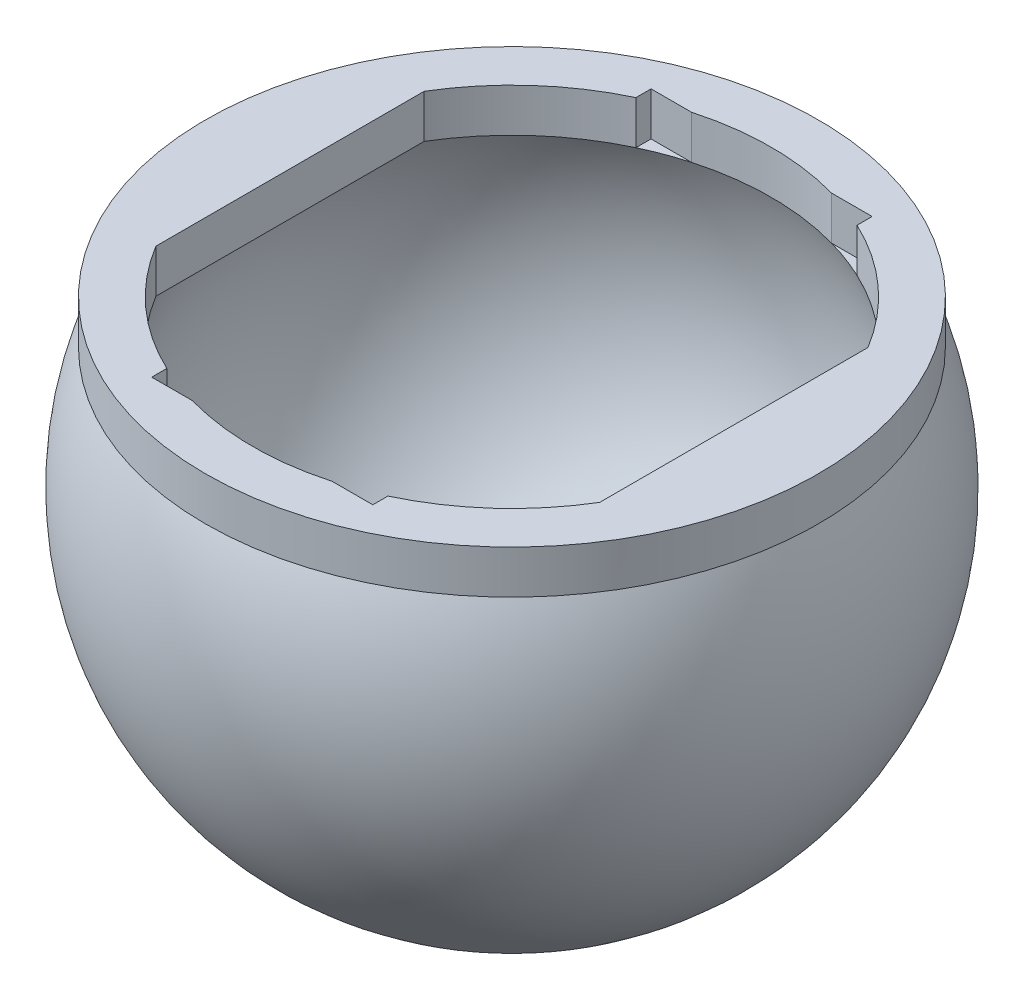
ISO-10303-21;
HEADER;
FILE_DESCRIPTION(('STEP AP214'),'2;1');
FILE_NAME('part.step','',(''),(''),'','','');
FILE_SCHEMA(('AUTOMOTIVE_DESIGN { 1 0 10303 214 1 1 1 1 }'));
ENDSEC;
DATA;
#1=APPLICATION_CONTEXT('core data for automotive mechanical design processes');
#2=APPLICATION_PROTOCOL_DEFINITION('international standard','automotive_design',2000,#1);
#3=PRODUCT_CONTEXT('',#1,'mechanical');
#4=PRODUCT('Part','Part','',(#3));
#5=PRODUCT_RELATED_PRODUCT_CATEGORY('part','',(#4));
#6=PRODUCT_DEFINITION_FORMATION('','',#4);
#7=PRODUCT_DEFINITION_CONTEXT('part definition',#1,'design');
#8=PRODUCT_DEFINITION('design','',#6,#7);
#9=PRODUCT_DEFINITION_SHAPE('','',#8);
#10=(LENGTH_UNIT() NAMED_UNIT(*) SI_UNIT(.MILLI.,.METRE.));
#11=(NAMED_UNIT(*) PLANE_ANGLE_UNIT() SI_UNIT($,.RADIAN.));
#12=(NAMED_UNIT(*) SI_UNIT($,.STERADIAN.) SOLID_ANGLE_UNIT());
#13=UNCERTAINTY_MEASURE_WITH_UNIT(LENGTH_MEASURE(1.E-05),#10,'distance_accuracy_value','');
#14=(GEOMETRIC_REPRESENTATION_CONTEXT(3) GLOBAL_UNCERTAINTY_ASSIGNED_CONTEXT((#13)) GLOBAL_UNIT_ASSIGNED_CONTEXT((#10,
#11,#12)) REPRESENTATION_CONTEXT('',''));
#15=CARTESIAN_POINT('',(0.,0.,0.));
#16=DIRECTION('',(0.,0.,1.));
#17=DIRECTION('',(1.,0.,0.));
#18=AXIS2_PLACEMENT_3D('',#15,#16,#17);
#19=CARTESIAN_POINT('',(0.,9.5,0.));
#20=DIRECTION('',(0.,-1.,0.));
#21=DIRECTION('',(0.,0.,-1.));
#22=AXIS2_PLACEMENT_3D('',#19,#20,#21);
#23=CYLINDRICAL_SURFACE('',#22,14.9415527974839);
#24=DIRECTION('',(0.,1.,0.));
#25=VECTOR('',#24,1.);
#26=CARTESIAN_POINT('',(6.37,7.,-13.5156612860785));
#27=LINE('',#26,#25);
#28=CARTESIAN_POINT('',(6.37,7.,-13.5156612860785));
#29=VERTEX_POINT('',#28);
#30=CARTESIAN_POINT('',(6.37,9.5,-13.5156612860785));
#31=VERTEX_POINT('',#30);
#32=EDGE_CURVE('E192',#29,#31,#27,.T.);
#33=ORIENTED_EDGE('',*,*,#32,.F.);
#34=CARTESIAN_POINT('',(0.,7.,0.));
#35=DIRECTION('',(0.,1.,0.));
#36=DIRECTION('',(0.,0.,1.));
#37=AXIS2_PLACEMENT_3D('',#34,#35,#36);
#38=CIRCLE('',#37,14.9415527974839);
#39=CARTESIAN_POINT('',(12.7867436961671,7.,-7.72975974067315));
#40=VERTEX_POINT('',#39);
#41=EDGE_CURVE('E267',#29,#40,#38,.F.);
#42=ORIENTED_EDGE('',*,*,#41,.T.);
#43=DIRECTION('',(0.,-1.,0.));
#44=VECTOR('',#43,1.);
#45=CARTESIAN_POINT('',(12.7867436961671,9.5,-7.72975974067315));
#46=LINE('',#45,#44);
#47=CARTESIAN_POINT('',(12.7867436961671,9.5,-7.72975974067315));
#48=VERTEX_POINT('',#47);
#49=EDGE_CURVE('E331',#48,#40,#46,.T.);
#50=ORIENTED_EDGE('',*,*,#49,.F.);
#51=CARTESIAN_POINT('',(0.,9.5,0.));
#52=DIRECTION('',(0.,1.,0.));
#53=DIRECTION('',(0.,0.,1.));
#54=AXIS2_PLACEMENT_3D('',#51,#52,#53);
#55=CIRCLE('',#54,14.9415527974839);
#56=EDGE_CURVE('E280',#31,#48,#55,.F.);
#57=ORIENTED_EDGE('',*,*,#56,.F.);
#58=EDGE_LOOP('',(#33,#42,#50,#57));
#59=FACE_BOUND('',#58,.T.);
#60=ADVANCED_FACE('F40',(#59),#23,.F.);
#61=CARTESIAN_POINT('',(-4.03112887414927,7.,-14.3874945699382));
#62=VERTEX_POINT('',#61);
#63=CARTESIAN_POINT('',(4.03112887414927,7.,-14.3874945699382));
#64=VERTEX_POINT('',#63);
#65=EDGE_CURVE('E303',#62,#64,#38,.F.);
#66=ORIENTED_EDGE('',*,*,#65,.T.);
#67=DIRECTION('',(0.,1.,0.));
#68=VECTOR('',#67,1.);
#69=CARTESIAN_POINT('',(4.03112887414927,7.,-14.3874945699382));
#70=LINE('',#69,#68);
#71=CARTESIAN_POINT('',(4.03112887414927,9.5,-14.3874945699382));
#72=VERTEX_POINT('',#71);
#73=EDGE_CURVE('E168',#64,#72,#70,.T.);
#74=ORIENTED_EDGE('',*,*,#73,.T.);
#75=CARTESIAN_POINT('',(-4.03112887414927,9.5,-14.3874945699382));
#76=VERTEX_POINT('',#75);
#77=EDGE_CURVE('E279',#76,#72,#55,.F.);
#78=ORIENTED_EDGE('',*,*,#77,.F.);
#79=DIRECTION('',(0.,1.,0.));
#80=VECTOR('',#79,1.);
#81=CARTESIAN_POINT('',(-4.03112887414927,7.,-14.3874945699382));
#82=LINE('',#81,#80);
#83=EDGE_CURVE('E264',#62,#76,#82,.T.);
#84=ORIENTED_EDGE('',*,*,#83,.F.);
#85=EDGE_LOOP('',(#66,#74,#78,#84));
#86=FACE_BOUND('',#85,.T.);
#87=ADVANCED_FACE('F397',(#86),#23,.F.);
#88=CARTESIAN_POINT('',(0.,9.5,0.));
#89=DIRECTION('',(0.,-1.,0.));
#90=DIRECTION('',(0.,0.,-1.));
#91=AXIS2_PLACEMENT_3D('',#88,#89,#90);
#92=CYLINDRICAL_SURFACE('',#91,14.9415527974839);
#93=DIRECTION('',(0.,1.,0.));
#94=VECTOR('',#93,1.);
#95=CARTESIAN_POINT('',(-6.37,7.,13.5156612860785));
#96=LINE('',#95,#94);
#97=CARTESIAN_POINT('',(-6.37,7.,13.5156612860785));
#98=VERTEX_POINT('',#97);
#99=CARTESIAN_POINT('',(-6.37,9.5,13.5156612860785));
#100=VERTEX_POINT('',#99);
#101=EDGE_CURVE('E212',#98,#100,#96,.T.);
#102=ORIENTED_EDGE('',*,*,#101,.F.);
#103=CARTESIAN_POINT('',(0.,7.,0.));
#104=DIRECTION('',(0.,1.,0.));
#105=DIRECTION('',(0.,0.,1.));
#106=AXIS2_PLACEMENT_3D('',#103,#104,#105);
#107=CIRCLE('',#106,14.9415527974839);
#108=CARTESIAN_POINT('',(-12.7867436961671,7.,7.72975974067315));
#109=VERTEX_POINT('',#108);
#110=EDGE_CURVE('E307',#98,#109,#107,.F.);
#111=ORIENTED_EDGE('',*,*,#110,.T.);
#112=DIRECTION('',(0.,-1.,0.));
#113=VECTOR('',#112,1.);
#114=CARTESIAN_POINT('',(-12.7867436961671,9.5,7.72975974067315));
#115=LINE('',#114,#113);
#116=CARTESIAN_POINT('',(-12.7867436961671,9.5,7.72975974067315));
#117=VERTEX_POINT('',#116);
#118=EDGE_CURVE('E324',#117,#109,#115,.T.);
#119=ORIENTED_EDGE('',*,*,#118,.F.);
#120=CARTESIAN_POINT('',(0.,9.5,0.));
#121=DIRECTION('',(0.,1.,0.));
#122=DIRECTION('',(0.,0.,1.));
#123=AXIS2_PLACEMENT_3D('',#120,#121,#122);
#124=CIRCLE('',#123,14.9415527974839);
#125=EDGE_CURVE('E283',#100,#117,#124,.F.);
#126=ORIENTED_EDGE('',*,*,#125,.F.);
#127=EDGE_LOOP('',(#102,#111,#119,#126));
#128=FACE_BOUND('',#127,.T.);
#129=ADVANCED_FACE('F355',(#128),#92,.F.);
#130=CARTESIAN_POINT('',(4.03112887414927,7.,14.3874945699382));
#131=VERTEX_POINT('',#130);
#132=CARTESIAN_POINT('',(-4.03112887414927,7.,14.3874945699382));
#133=VERTEX_POINT('',#132);
#134=EDGE_CURVE('E313',#131,#133,#107,.F.);
#135=ORIENTED_EDGE('',*,*,#134,.T.);
#136=DIRECTION('',(0.,1.,0.));
#137=VECTOR('',#136,1.);
#138=CARTESIAN_POINT('',(-4.03112887414927,7.,14.3874945699382));
#139=LINE('',#138,#137);
#140=CARTESIAN_POINT('',(-4.03112887414927,9.5,14.3874945699382));
#141=VERTEX_POINT('',#140);
#142=EDGE_CURVE('E241',#133,#141,#139,.T.);
#143=ORIENTED_EDGE('',*,*,#142,.T.);
#144=CARTESIAN_POINT('',(4.03112887414927,9.5,14.3874945699382));
#145=VERTEX_POINT('',#144);
#146=EDGE_CURVE('E289',#145,#141,#124,.F.);
#147=ORIENTED_EDGE('',*,*,#146,.F.);
#148=DIRECTION('',(0.,1.,0.));
#149=VECTOR('',#148,1.);
#150=CARTESIAN_POINT('',(4.03112887414927,7.,14.3874945699382));
#151=LINE('',#150,#149);
#152=EDGE_CURVE('E189',#131,#145,#151,.T.);
#153=ORIENTED_EDGE('',*,*,#152,.F.);
#154=EDGE_LOOP('',(#135,#143,#147,#153));
#155=FACE_BOUND('',#154,.T.);
#156=ADVANCED_FACE('F363',(#155),#92,.F.);
#157=CARTESIAN_POINT('',(0.,9.5,0.));
#158=DIRECTION('',(0.,1.,0.));
#159=DIRECTION('',(0.,0.,1.));
#160=AXIS2_PLACEMENT_3D('',#157,#158,#159);
#161=PLANE('',#160);
#162=CARTESIAN_POINT('',(0.,9.5,0.));
#163=DIRECTION('',(0.,1.,0.));
#164=DIRECTION('',(0.,0.,1.));
#165=AXIS2_PLACEMENT_3D('',#162,#163,#164);
#166=CIRCLE('',#165,17.6635217326557);
#167=CARTESIAN_POINT('',(0.,9.5,17.6635217326557));
#168=VERTEX_POINT('',#167);
#169=EDGE_CURVE('E293',#168,#168,#166,.T.);
#170=ORIENTED_EDGE('',*,*,#169,.T.);
#171=EDGE_LOOP('',(#170));
#172=FACE_BOUND('',#171,.T.);
#173=DIRECTION('',(1.,0.,0.));
#174=VECTOR('',#173,1.);
#175=CARTESIAN_POINT('',(0.,9.5,14.3874945699382));
#176=LINE('',#175,#174);
#177=CARTESIAN_POINT('',(-6.36999999999999,9.5,14.3874945699382));
#178=VERTEX_POINT('',#177);
#179=EDGE_CURVE('E226',#178,#141,#176,.T.);
#180=ORIENTED_EDGE('',*,*,#179,.F.);
#181=DIRECTION('',(0.,0.,-1.));
#182=VECTOR('',#181,1.);
#183=CARTESIAN_POINT('',(-6.37000000000004,9.5,0.));
#184=LINE('',#183,#182);
#185=EDGE_CURVE('E233',#178,#100,#184,.T.);
#186=ORIENTED_EDGE('',*,*,#185,.T.);
#187=ORIENTED_EDGE('',*,*,#125,.T.);
#188=DIRECTION('',(0.,0.,1.));
#189=VECTOR('',#188,1.);
#190=CARTESIAN_POINT('',(-12.7867436961671,9.5,0.));
#191=LINE('',#190,#189);
#192=CARTESIAN_POINT('',(-12.7867436961671,9.5,-7.72975974067315));
#193=VERTEX_POINT('',#192);
#194=EDGE_CURVE('E288',#193,#117,#191,.T.);
#195=ORIENTED_EDGE('',*,*,#194,.F.);
#196=CARTESIAN_POINT('',(-6.37,9.5,-13.5156612860785));
#197=VERTEX_POINT('',#196);
#198=EDGE_CURVE('E274',#193,#197,#55,.F.);
#199=ORIENTED_EDGE('',*,*,#198,.T.);
#200=DIRECTION('',(0.,0.,1.));
#201=VECTOR('',#200,1.);
#202=CARTESIAN_POINT('',(-6.37000000000004,9.5,0.));
#203=LINE('',#202,#201);
#204=CARTESIAN_POINT('',(-6.36999999999999,9.5,-14.3874945699382));
#205=VERTEX_POINT('',#204);
#206=EDGE_CURVE('E251',#205,#197,#203,.T.);
#207=ORIENTED_EDGE('',*,*,#206,.F.);
#208=DIRECTION('',(1.,0.,0.));
#209=VECTOR('',#208,1.);
#210=CARTESIAN_POINT('',(0.,9.5,-14.3874945699382));
#211=LINE('',#210,#209);
#212=EDGE_CURVE('E195',#205,#76,#211,.T.);
#213=ORIENTED_EDGE('',*,*,#212,.T.);
#214=ORIENTED_EDGE('',*,*,#77,.T.);
#215=DIRECTION('',(-1.,0.,0.));
#216=VECTOR('',#215,1.);
#217=CARTESIAN_POINT('',(0.,9.5,-14.3874945699382));
#218=LINE('',#217,#216);
#219=CARTESIAN_POINT('',(6.36999999999999,9.5,-14.3874945699382));
#220=VERTEX_POINT('',#219);
#221=EDGE_CURVE('E178',#220,#72,#218,.T.);
#222=ORIENTED_EDGE('',*,*,#221,.F.);
#223=DIRECTION('',(0.,0.,1.));
#224=VECTOR('',#223,1.);
#225=CARTESIAN_POINT('',(6.37000000000004,9.5,0.));
#226=LINE('',#225,#224);
#227=EDGE_CURVE('E163',#220,#31,#226,.T.);
#228=ORIENTED_EDGE('',*,*,#227,.T.);
#229=ORIENTED_EDGE('',*,*,#56,.T.);
#230=DIRECTION('',(0.,0.,1.));
#231=VECTOR('',#230,1.);
#232=CARTESIAN_POINT('',(12.7867436961671,9.5,0.));
#233=LINE('',#232,#231);
#234=CARTESIAN_POINT('',(12.7867436961671,9.5,7.72975974067315));
#235=VERTEX_POINT('',#234);
#236=EDGE_CURVE('E278',#48,#235,#233,.T.);
#237=ORIENTED_EDGE('',*,*,#236,.T.);
#238=CARTESIAN_POINT('',(6.37,9.5,13.5156612860785));
#239=VERTEX_POINT('',#238);
#240=EDGE_CURVE('E284',#235,#239,#124,.F.);
#241=ORIENTED_EDGE('',*,*,#240,.T.);
#242=DIRECTION('',(0.,0.,-1.));
#243=VECTOR('',#242,1.);
#244=CARTESIAN_POINT('',(6.37000000000004,9.5,0.));
#245=LINE('',#244,#243);
#246=CARTESIAN_POINT('',(6.36999999999999,9.5,14.3874945699382));
#247=VERTEX_POINT('',#246);
#248=EDGE_CURVE('E201',#247,#239,#245,.T.);
#249=ORIENTED_EDGE('',*,*,#248,.F.);
#250=DIRECTION('',(-1.,0.,0.));
#251=VECTOR('',#250,1.);
#252=CARTESIAN_POINT('',(0.,9.5,14.3874945699382));
#253=LINE('',#252,#251);
#254=EDGE_CURVE('E208',#247,#145,#253,.T.);
#255=ORIENTED_EDGE('',*,*,#254,.T.);
#256=ORIENTED_EDGE('',*,*,#146,.T.);
#257=EDGE_LOOP('',(#180,#186,#187,#195,#199,#207,#213,#214,#222,#228,#229,#237,#241,#249,#255,#256));
#258=FACE_BOUND('',#257,.T.);
#259=ADVANCED_FACE('F376',(#172,#258),#161,.T.);
#260=CARTESIAN_POINT('',(0.,0.,0.));
#261=DIRECTION('',(0.,-1.,0.));
#262=DIRECTION('',(-1.,0.,0.));
#263=AXIS2_PLACEMENT_3D('',#260,#261,#262);
#264=SPHERICAL_SURFACE('',#263,19.);
#265=CARTESIAN_POINT('',(0.,7.,0.));
#266=DIRECTION('',(0.,1.,0.));
#267=DIRECTION('',(0.,0.,1.));
#268=AXIS2_PLACEMENT_3D('',#265,#266,#267);
#269=CIRCLE('',#268,17.6635217326557);
#270=CARTESIAN_POINT('',(0.,7.,17.6635217326557));
#271=VERTEX_POINT('',#270);
#272=EDGE_CURVE('E317',#271,#271,#269,.T.);
#273=ORIENTED_EDGE('',*,*,#272,.F.);
#274=EDGE_LOOP('',(#273));
#275=FACE_BOUND('',#274,.T.);
#276=ADVANCED_FACE('F42',(#275),#264,.T.);
#277=CARTESIAN_POINT('',(0.,7.,0.));
#278=DIRECTION('',(0.,1.,0.));
#279=DIRECTION('',(0.,0.,1.));
#280=AXIS2_PLACEMENT_3D('',#277,#278,#279);
#281=PLANE('',#280);
#282=DIRECTION('',(0.,0.,1.));
#283=VECTOR('',#282,1.);
#284=CARTESIAN_POINT('',(-12.7867436961671,7.,0.));
#285=LINE('',#284,#283);
#286=CARTESIAN_POINT('',(-12.7867436961671,7.,-7.72975974067315));
#287=VERTEX_POINT('',#286);
#288=EDGE_CURVE('E312',#287,#109,#285,.T.);
#289=ORIENTED_EDGE('',*,*,#288,.T.);
#290=CARTESIAN_POINT('',(0.,7.,0.));
#291=DIRECTION('',(0.,-1.,0.));
#292=DIRECTION('',(0.,0.,-1.));
#293=AXIS2_PLACEMENT_3D('',#290,#291,#292);
#294=CIRCLE('',#293,14.9415527974839);
#295=EDGE_CURVE('E49',#109,#287,#294,.T.);
#296=ORIENTED_EDGE('',*,*,#295,.T.);
#297=EDGE_LOOP('',(#289,#296));
#298=FACE_BOUND('',#297,.T.);
#299=ADVANCED_FACE('F341',(#298),#281,.F.);
#300=DIRECTION('',(0.,0.,1.));
#301=VECTOR('',#300,1.);
#302=CARTESIAN_POINT('',(12.7867436961671,7.,0.));
#303=LINE('',#302,#301);
#304=CARTESIAN_POINT('',(12.7867436961671,7.,7.72975974067315));
#305=VERTEX_POINT('',#304);
#306=EDGE_CURVE('E302',#40,#305,#303,.T.);
#307=ORIENTED_EDGE('',*,*,#306,.F.);
#308=EDGE_CURVE('E11',#40,#305,#294,.T.);
#309=ORIENTED_EDGE('',*,*,#308,.T.);
#310=EDGE_LOOP('',(#307,#309));
#311=FACE_BOUND('',#310,.T.);
#312=ADVANCED_FACE('F405',(#311),#281,.F.);
#313=CARTESIAN_POINT('',(-6.37,7.,-13.5156612860785));
#314=VERTEX_POINT('',#313);
#315=EDGE_CURVE('E298',#287,#314,#38,.F.);
#316=ORIENTED_EDGE('',*,*,#315,.T.);
#317=DIRECTION('',(0.,1.,0.));
#318=VECTOR('',#317,1.);
#319=CARTESIAN_POINT('',(-6.37,7.,-13.5156612860785));
#320=LINE('',#319,#318);
#321=EDGE_CURVE('E268',#314,#197,#320,.T.);
#322=ORIENTED_EDGE('',*,*,#321,.T.);
#323=ORIENTED_EDGE('',*,*,#198,.F.);
#324=DIRECTION('',(0.,-1.,0.));
#325=VECTOR('',#324,1.);
#326=CARTESIAN_POINT('',(-12.7867436961671,9.5,-7.72975974067315));
#327=LINE('',#326,#325);
#328=EDGE_CURVE('E297',#193,#287,#327,.T.);
#329=ORIENTED_EDGE('',*,*,#328,.T.);
#330=EDGE_LOOP('',(#316,#322,#323,#329));
#331=FACE_BOUND('',#330,.T.);
#332=ADVANCED_FACE('F347',(#331),#23,.F.);
#333=CARTESIAN_POINT('',(12.7867436961671,9.5,0.));
#334=DIRECTION('',(1.,0.,0.));
#335=DIRECTION('',(0.,0.,-1.));
#336=AXIS2_PLACEMENT_3D('',#333,#334,#335);
#337=PLANE('',#336);
#338=ORIENTED_EDGE('',*,*,#306,.T.);
#339=DIRECTION('',(0.,-1.,0.));
#340=VECTOR('',#339,1.);
#341=CARTESIAN_POINT('',(12.7867436961671,9.5,7.72975974067315));
#342=LINE('',#341,#340);
#343=EDGE_CURVE('E328',#235,#305,#342,.T.);
#344=ORIENTED_EDGE('',*,*,#343,.F.);
#345=ORIENTED_EDGE('',*,*,#236,.F.);
#346=ORIENTED_EDGE('',*,*,#49,.T.);
#347=EDGE_LOOP('',(#338,#344,#345,#346));
#348=FACE_BOUND('',#347,.T.);
#349=ADVANCED_FACE('F407',(#348),#337,.F.);
#350=CARTESIAN_POINT('',(6.37,7.,13.5156612860785));
#351=VERTEX_POINT('',#350);
#352=EDGE_CURVE('E308',#305,#351,#107,.F.);
#353=ORIENTED_EDGE('',*,*,#352,.T.);
#354=DIRECTION('',(0.,1.,0.));
#355=VECTOR('',#354,1.);
#356=CARTESIAN_POINT('',(6.37,7.,13.5156612860785));
#357=LINE('',#356,#355);
#358=EDGE_CURVE('E217',#351,#239,#357,.T.);
#359=ORIENTED_EDGE('',*,*,#358,.T.);
#360=ORIENTED_EDGE('',*,*,#240,.F.);
#361=ORIENTED_EDGE('',*,*,#343,.T.);
#362=EDGE_LOOP('',(#353,#359,#360,#361));
#363=FACE_BOUND('',#362,.T.);
#364=ADVANCED_FACE('F410',(#363),#92,.F.);
#365=CARTESIAN_POINT('',(-12.7867436961671,9.5,0.));
#366=DIRECTION('',(1.,0.,0.));
#367=DIRECTION('',(0.,0.,-1.));
#368=AXIS2_PLACEMENT_3D('',#365,#366,#367);
#369=PLANE('',#368);
#370=ORIENTED_EDGE('',*,*,#288,.F.);
#371=ORIENTED_EDGE('',*,*,#328,.F.);
#372=ORIENTED_EDGE('',*,*,#194,.T.);
#373=ORIENTED_EDGE('',*,*,#118,.T.);
#374=EDGE_LOOP('',(#370,#371,#372,#373));
#375=FACE_BOUND('',#374,.T.);
#376=ADVANCED_FACE('F350',(#375),#369,.T.);
#377=CARTESIAN_POINT('',(0.,9.5,0.));
#378=DIRECTION('',(0.,-1.,0.));
#379=DIRECTION('',(0.,0.,-1.));
#380=AXIS2_PLACEMENT_3D('',#377,#378,#379);
#381=CYLINDRICAL_SURFACE('',#380,17.6635217326557);
#382=ORIENTED_EDGE('',*,*,#169,.F.);
#383=EDGE_LOOP('',(#382));
#384=FACE_BOUND('',#383,.T.);
#385=ORIENTED_EDGE('',*,*,#272,.T.);
#386=EDGE_LOOP('',(#385));
#387=FACE_BOUND('',#386,.T.);
#388=ADVANCED_FACE('F449',(#384,#387),#381,.T.);
#389=CARTESIAN_POINT('',(0.,0.,0.));
#390=DIRECTION('',(0.,-1.,0.));
#391=DIRECTION('',(-1.,0.,0.));
#392=AXIS2_PLACEMENT_3D('',#389,#390,#391);
#393=SPHERICAL_SURFACE('',#392,16.5);
#394=ORIENTED_EDGE('',*,*,#308,.F.);
#395=ORIENTED_EDGE('',*,*,#41,.F.);
#396=CARTESIAN_POINT('',(0.,7.,0.));
#397=DIRECTION('',(0.,1.,0.));
#398=DIRECTION('',(0.,0.,1.));
#399=AXIS2_PLACEMENT_3D('',#396,#397,#398);
#400=CIRCLE('',#399,14.9415527974839);
#401=EDGE_CURVE('E169',#64,#29,#400,.F.);
#402=ORIENTED_EDGE('',*,*,#401,.F.);
#403=ORIENTED_EDGE('',*,*,#65,.F.);
#404=CARTESIAN_POINT('',(0.,7.,0.));
#405=DIRECTION('',(0.,1.,0.));
#406=DIRECTION('',(0.,0.,1.));
#407=AXIS2_PLACEMENT_3D('',#404,#405,#406);
#408=CIRCLE('',#407,14.9415527974839);
#409=EDGE_CURVE('E254',#314,#62,#408,.F.);
#410=ORIENTED_EDGE('',*,*,#409,.F.);
#411=ORIENTED_EDGE('',*,*,#315,.F.);
#412=ORIENTED_EDGE('',*,*,#295,.F.);
#413=ORIENTED_EDGE('',*,*,#110,.F.);
#414=CARTESIAN_POINT('',(0.,7.,0.));
#415=DIRECTION('',(0.,1.,0.));
#416=DIRECTION('',(0.,0.,1.));
#417=AXIS2_PLACEMENT_3D('',#414,#415,#416);
#418=CIRCLE('',#417,14.9415527974839);
#419=EDGE_CURVE('E229',#133,#98,#418,.F.);
#420=ORIENTED_EDGE('',*,*,#419,.F.);
#421=ORIENTED_EDGE('',*,*,#134,.F.);
#422=CARTESIAN_POINT('',(0.,7.,0.));
#423=DIRECTION('',(0.,1.,0.));
#424=DIRECTION('',(0.,0.,1.));
#425=AXIS2_PLACEMENT_3D('',#422,#423,#424);
#426=CIRCLE('',#425,14.9415527974839);
#427=EDGE_CURVE('E204',#351,#131,#426,.F.);
#428=ORIENTED_EDGE('',*,*,#427,.F.);
#429=ORIENTED_EDGE('',*,*,#352,.F.);
#430=EDGE_LOOP('',(#394,#395,#402,#403,#410,#411,#412,#413,#420,#421,#428,#429));
#431=FACE_BOUND('',#430,.T.);
#432=ADVANCED_FACE('F368',(#431),#393,.F.);
#433=CARTESIAN_POINT('',(0.,7.,-14.3874945699382));
#434=DIRECTION('',(0.,0.,1.));
#435=DIRECTION('',(1.,0.,0.));
#436=AXIS2_PLACEMENT_3D('',#433,#434,#435);
#437=PLANE('',#436);
#438=ORIENTED_EDGE('',*,*,#212,.F.);
#439=DIRECTION('',(0.,1.,0.));
#440=VECTOR('',#439,1.);
#441=CARTESIAN_POINT('',(-6.36999999999999,7.,-14.3874945699382));
#442=LINE('',#441,#440);
#443=CARTESIAN_POINT('',(-6.36999999999999,7.,-14.3874945699382));
#444=VERTEX_POINT('',#443);
#445=EDGE_CURVE('E258',#444,#205,#442,.T.);
#446=ORIENTED_EDGE('',*,*,#445,.F.);
#447=DIRECTION('',(1.,0.,0.));
#448=VECTOR('',#447,1.);
#449=CARTESIAN_POINT('',(0.,7.,-14.3874945699382));
#450=LINE('',#449,#448);
#451=EDGE_CURVE('E247',#444,#62,#450,.T.);
#452=ORIENTED_EDGE('',*,*,#451,.T.);
#453=ORIENTED_EDGE('',*,*,#83,.T.);
#454=EDGE_LOOP('',(#438,#446,#452,#453));
#455=FACE_BOUND('',#454,.T.);
#456=ADVANCED_FACE('F392',(#455),#437,.T.);
#457=CARTESIAN_POINT('',(-6.37000000000004,7.,0.));
#458=DIRECTION('',(-1.,0.,0.));
#459=DIRECTION('',(0.,0.,1.));
#460=AXIS2_PLACEMENT_3D('',#457,#458,#459);
#461=PLANE('',#460);
#462=ORIENTED_EDGE('',*,*,#206,.T.);
#463=ORIENTED_EDGE('',*,*,#321,.F.);
#464=DIRECTION('',(0.,0.,1.));
#465=VECTOR('',#464,1.);
#466=CARTESIAN_POINT('',(-6.37000000000004,7.,0.));
#467=LINE('',#466,#465);
#468=EDGE_CURVE('E250',#444,#314,#467,.T.);
#469=ORIENTED_EDGE('',*,*,#468,.F.);
#470=ORIENTED_EDGE('',*,*,#445,.T.);
#471=EDGE_LOOP('',(#462,#463,#469,#470));
#472=FACE_BOUND('',#471,.T.);
#473=ADVANCED_FACE('F387',(#472),#461,.F.);
#474=CARTESIAN_POINT('',(0.,7.,0.));
#475=DIRECTION('',(0.,1.,0.));
#476=DIRECTION('',(0.,0.,1.));
#477=AXIS2_PLACEMENT_3D('',#474,#475,#476);
#478=PLANE('',#477);
#479=ORIENTED_EDGE('',*,*,#451,.F.);
#480=ORIENTED_EDGE('',*,*,#468,.T.);
#481=ORIENTED_EDGE('',*,*,#409,.T.);
#482=EDGE_LOOP('',(#479,#480,#481));
#483=FACE_BOUND('',#482,.T.);
#484=ADVANCED_FACE('F549',(#483),#478,.T.);
#485=CARTESIAN_POINT('',(6.37000000000004,7.,0.));
#486=DIRECTION('',(-1.,0.,0.));
#487=DIRECTION('',(0.,0.,1.));
#488=AXIS2_PLACEMENT_3D('',#485,#486,#487);
#489=PLANE('',#488);
#490=ORIENTED_EDGE('',*,*,#227,.F.);
#491=DIRECTION('',(0.,1.,0.));
#492=VECTOR('',#491,1.);
#493=CARTESIAN_POINT('',(6.36999999999999,7.,-14.3874945699382));
#494=LINE('',#493,#492);
#495=CARTESIAN_POINT('',(6.36999999999999,7.,-14.3874945699382));
#496=VERTEX_POINT('',#495);
#497=EDGE_CURVE('E157',#496,#220,#494,.T.);
#498=ORIENTED_EDGE('',*,*,#497,.F.);
#499=DIRECTION('',(0.,0.,1.));
#500=VECTOR('',#499,1.);
#501=CARTESIAN_POINT('',(6.37000000000004,7.,0.));
#502=LINE('',#501,#500);
#503=EDGE_CURVE('E160',#496,#29,#502,.T.);
#504=ORIENTED_EDGE('',*,*,#503,.T.);
#505=ORIENTED_EDGE('',*,*,#32,.T.);
#506=EDGE_LOOP('',(#490,#498,#504,#505));
#507=FACE_BOUND('',#506,.T.);
#508=ADVANCED_FACE('F159',(#507),#489,.T.);
#509=CARTESIAN_POINT('',(0.,7.,-14.3874945699382));
#510=DIRECTION('',(0.,0.,-1.));
#511=DIRECTION('',(-1.,0.,0.));
#512=AXIS2_PLACEMENT_3D('',#509,#510,#511);
#513=PLANE('',#512);
#514=ORIENTED_EDGE('',*,*,#221,.T.);
#515=ORIENTED_EDGE('',*,*,#73,.F.);
#516=DIRECTION('',(-1.,0.,0.));
#517=VECTOR('',#516,1.);
#518=CARTESIAN_POINT('',(0.,7.,-14.3874945699382));
#519=LINE('',#518,#517);
#520=EDGE_CURVE('E173',#496,#64,#519,.T.);
#521=ORIENTED_EDGE('',*,*,#520,.F.);
#522=ORIENTED_EDGE('',*,*,#497,.T.);
#523=EDGE_LOOP('',(#514,#515,#521,#522));
#524=FACE_BOUND('',#523,.T.);
#525=ADVANCED_FACE('F180',(#524),#513,.F.);
#526=CARTESIAN_POINT('',(0.,7.,0.));
#527=DIRECTION('',(0.,1.,0.));
#528=DIRECTION('',(0.,0.,1.));
#529=AXIS2_PLACEMENT_3D('',#526,#527,#528);
#530=PLANE('',#529);
#531=ORIENTED_EDGE('',*,*,#503,.F.);
#532=ORIENTED_EDGE('',*,*,#520,.T.);
#533=ORIENTED_EDGE('',*,*,#401,.T.);
#534=EDGE_LOOP('',(#531,#532,#533));
#535=FACE_BOUND('',#534,.T.);
#536=ADVANCED_FACE('F172',(#535),#530,.T.);
#537=CARTESIAN_POINT('',(0.,7.,14.3874945699382));
#538=DIRECTION('',(0.,0.,-1.));
#539=DIRECTION('',(-1.,0.,0.));
#540=AXIS2_PLACEMENT_3D('',#537,#538,#539);
#541=PLANE('',#540);
#542=ORIENTED_EDGE('',*,*,#254,.F.);
#543=DIRECTION('',(0.,1.,0.));
#544=VECTOR('',#543,1.);
#545=CARTESIAN_POINT('',(6.36999999999999,7.,14.3874945699382));
#546=LINE('',#545,#544);
#547=CARTESIAN_POINT('',(6.36999999999999,7.,14.3874945699382));
#548=VERTEX_POINT('',#547);
#549=EDGE_CURVE('E207',#548,#247,#546,.T.);
#550=ORIENTED_EDGE('',*,*,#549,.F.);
#551=DIRECTION('',(-1.,0.,0.));
#552=VECTOR('',#551,1.);
#553=CARTESIAN_POINT('',(0.,7.,14.3874945699382));
#554=LINE('',#553,#552);
#555=EDGE_CURVE('E198',#548,#131,#554,.T.);
#556=ORIENTED_EDGE('',*,*,#555,.T.);
#557=ORIENTED_EDGE('',*,*,#152,.T.);
#558=EDGE_LOOP('',(#542,#550,#556,#557));
#559=FACE_BOUND('',#558,.T.);
#560=ADVANCED_FACE('F416',(#559),#541,.T.);
#561=CARTESIAN_POINT('',(6.37000000000004,7.,0.));
#562=DIRECTION('',(1.,0.,0.));
#563=DIRECTION('',(0.,0.,-1.));
#564=AXIS2_PLACEMENT_3D('',#561,#562,#563);
#565=PLANE('',#564);
#566=ORIENTED_EDGE('',*,*,#248,.T.);
#567=ORIENTED_EDGE('',*,*,#358,.F.);
#568=DIRECTION('',(0.,0.,-1.));
#569=VECTOR('',#568,1.);
#570=CARTESIAN_POINT('',(6.37000000000004,7.,0.));
#571=LINE('',#570,#569);
#572=EDGE_CURVE('E64',#548,#351,#571,.T.);
#573=ORIENTED_EDGE('',*,*,#572,.F.);
#574=ORIENTED_EDGE('',*,*,#549,.T.);
#575=EDGE_LOOP('',(#566,#567,#573,#574));
#576=FACE_BOUND('',#575,.T.);
#577=ADVANCED_FACE('F414',(#576),#565,.F.);
#578=CARTESIAN_POINT('',(0.,7.,0.));
#579=DIRECTION('',(0.,1.,0.));
#580=DIRECTION('',(0.,0.,1.));
#581=AXIS2_PLACEMENT_3D('',#578,#579,#580);
#582=PLANE('',#581);
#583=ORIENTED_EDGE('',*,*,#555,.F.);
#584=ORIENTED_EDGE('',*,*,#572,.T.);
#585=ORIENTED_EDGE('',*,*,#427,.T.);
#586=EDGE_LOOP('',(#583,#584,#585));
#587=FACE_BOUND('',#586,.T.);
#588=ADVANCED_FACE('F417',(#587),#582,.T.);
#589=CARTESIAN_POINT('',(-6.37000000000004,7.,0.));
#590=DIRECTION('',(1.,0.,0.));
#591=DIRECTION('',(0.,0.,-1.));
#592=AXIS2_PLACEMENT_3D('',#589,#590,#591);
#593=PLANE('',#592);
#594=ORIENTED_EDGE('',*,*,#185,.F.);
#595=DIRECTION('',(0.,1.,0.));
#596=VECTOR('',#595,1.);
#597=CARTESIAN_POINT('',(-6.36999999999999,7.,14.3874945699382));
#598=LINE('',#597,#596);
#599=CARTESIAN_POINT('',(-6.36999999999999,7.,14.3874945699382));
#600=VERTEX_POINT('',#599);
#601=EDGE_CURVE('E232',#600,#178,#598,.T.);
#602=ORIENTED_EDGE('',*,*,#601,.F.);
#603=DIRECTION('',(0.,0.,-1.));
#604=VECTOR('',#603,1.);
#605=CARTESIAN_POINT('',(-6.37000000000004,7.,0.));
#606=LINE('',#605,#604);
#607=EDGE_CURVE('E223',#600,#98,#606,.T.);
#608=ORIENTED_EDGE('',*,*,#607,.T.);
#609=ORIENTED_EDGE('',*,*,#101,.T.);
#610=EDGE_LOOP('',(#594,#602,#608,#609));
#611=FACE_BOUND('',#610,.T.);
#612=ADVANCED_FACE('F419',(#611),#593,.T.);
#613=CARTESIAN_POINT('',(0.,7.,14.3874945699382));
#614=DIRECTION('',(0.,0.,1.));
#615=DIRECTION('',(1.,0.,0.));
#616=AXIS2_PLACEMENT_3D('',#613,#614,#615);
#617=PLANE('',#616);
#618=ORIENTED_EDGE('',*,*,#179,.T.);
#619=ORIENTED_EDGE('',*,*,#142,.F.);
#620=DIRECTION('',(1.,0.,0.));
#621=VECTOR('',#620,1.);
#622=CARTESIAN_POINT('',(0.,7.,14.3874945699382));
#623=LINE('',#622,#621);
#624=EDGE_CURVE('E56',#600,#133,#623,.T.);
#625=ORIENTED_EDGE('',*,*,#624,.F.);
#626=ORIENTED_EDGE('',*,*,#601,.T.);
#627=EDGE_LOOP('',(#618,#619,#625,#626));
#628=FACE_BOUND('',#627,.T.);
#629=ADVANCED_FACE('F372',(#628),#617,.F.);
#630=CARTESIAN_POINT('',(0.,7.,0.));
#631=DIRECTION('',(0.,1.,0.));
#632=DIRECTION('',(0.,0.,1.));
#633=AXIS2_PLACEMENT_3D('',#630,#631,#632);
#634=PLANE('',#633);
#635=ORIENTED_EDGE('',*,*,#607,.F.);
#636=ORIENTED_EDGE('',*,*,#624,.T.);
#637=ORIENTED_EDGE('',*,*,#419,.T.);
#638=EDGE_LOOP('',(#635,#636,#637));
#639=FACE_BOUND('',#638,.T.);
#640=ADVANCED_FACE('F369',(#639),#634,.T.);
#641=CLOSED_SHELL('',(#60,#87,#129,#156,#259,#276,#299,#312,#332,#349,#364,#376,#388,#432,#456,
#473,#484,#508,#525,#536,#560,#577,#588,#612,#629,#640));
#642=MANIFOLD_SOLID_BREP('B2',#641);
#643=ADVANCED_BREP_SHAPE_REPRESENTATION('',(#18,#642),#14);
#644=SHAPE_DEFINITION_REPRESENTATION(#9,#643);
ENDSEC;
END-ISO-10303-21;
